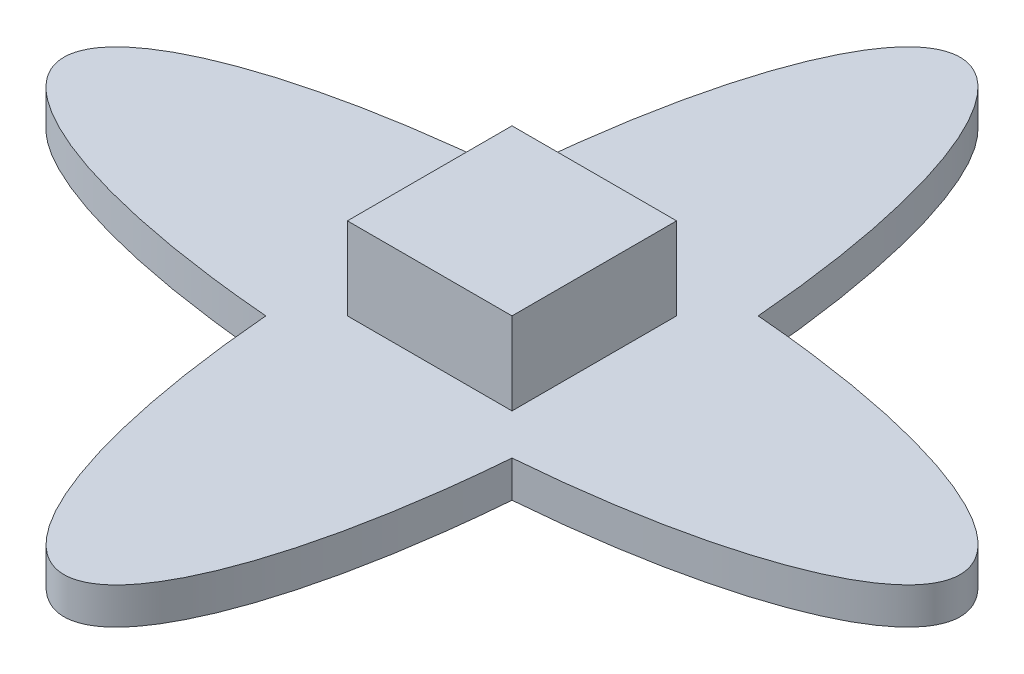
ISO-10303-21;
HEADER;
FILE_DESCRIPTION(('STEP AP214'),'2;1');
FILE_NAME('part.step','',(''),(''),'','','');
FILE_SCHEMA(('AUTOMOTIVE_DESIGN { 1 0 10303 214 1 1 1 1 }'));
ENDSEC;
DATA;
#1=APPLICATION_CONTEXT('core data for automotive mechanical design processes');
#2=APPLICATION_PROTOCOL_DEFINITION('international standard','automotive_design',2000,#1);
#3=PRODUCT_CONTEXT('',#1,'mechanical');
#4=PRODUCT('Part','Part','',(#3));
#5=PRODUCT_RELATED_PRODUCT_CATEGORY('part','',(#4));
#6=PRODUCT_DEFINITION_FORMATION('','',#4);
#7=PRODUCT_DEFINITION_CONTEXT('part definition',#1,'design');
#8=PRODUCT_DEFINITION('design','',#6,#7);
#9=PRODUCT_DEFINITION_SHAPE('','',#8);
#10=(LENGTH_UNIT() NAMED_UNIT(*) SI_UNIT(.MILLI.,.METRE.));
#11=(NAMED_UNIT(*) PLANE_ANGLE_UNIT() SI_UNIT($,.RADIAN.));
#12=(NAMED_UNIT(*) SI_UNIT($,.STERADIAN.) SOLID_ANGLE_UNIT());
#13=UNCERTAINTY_MEASURE_WITH_UNIT(LENGTH_MEASURE(1.E-05),#10,'distance_accuracy_value','');
#14=(GEOMETRIC_REPRESENTATION_CONTEXT(3) GLOBAL_UNCERTAINTY_ASSIGNED_CONTEXT((#13)) GLOBAL_UNIT_ASSIGNED_CONTEXT((#10,
#11,#12)) REPRESENTATION_CONTEXT('',''));
#15=CARTESIAN_POINT('',(0.,0.,0.));
#16=DIRECTION('',(0.,0.,1.));
#17=DIRECTION('',(1.,0.,0.));
#18=AXIS2_PLACEMENT_3D('',#15,#16,#17);
#19=CARTESIAN_POINT('',(0.,2.,0.));
#20=DIRECTION('',(0.,1.,0.));
#21=DIRECTION('',(0.,0.,1.));
#22=AXIS2_PLACEMENT_3D('',#19,#20,#21);
#23=PLANE('',#22);
#24=CARTESIAN_POINT('',(0.,2.,0.));
#25=DIRECTION('',(0.,1.,0.));
#26=DIRECTION('',(0.,0.,1.));
#27=AXIS2_PLACEMENT_3D('',#24,#25,#26);
#28=ELLIPSE('',#27,24.5,7.);
#29=CARTESIAN_POINT('',(-6.73066763348577,2.,6.73066763348574));
#30=VERTEX_POINT('',#29);
#31=CARTESIAN_POINT('',(6.73066763348576,2.,6.73066763348578));
#32=VERTEX_POINT('',#31);
#33=EDGE_CURVE('E152',#30,#32,#28,.T.);
#34=ORIENTED_EDGE('',*,*,#33,.T.);
#35=CARTESIAN_POINT('',(0.,2.,0.));
#36=DIRECTION('',(0.,1.,0.));
#37=DIRECTION('',(-1.,0.,0.));
#38=AXIS2_PLACEMENT_3D('',#35,#36,#37);
#39=ELLIPSE('',#38,24.5,7.);
#40=CARTESIAN_POINT('',(6.73066763348576,2.,-6.73066763348574));
#41=VERTEX_POINT('',#40);
#42=EDGE_CURVE('E93',#32,#41,#39,.T.);
#43=ORIENTED_EDGE('',*,*,#42,.T.);
#44=CARTESIAN_POINT('',(0.,2.,0.));
#45=DIRECTION('',(0.,1.,0.));
#46=DIRECTION('',(0.,0.,1.));
#47=AXIS2_PLACEMENT_3D('',#44,#45,#46);
#48=ELLIPSE('',#47,24.5,7.);
#49=CARTESIAN_POINT('',(-6.73066763348576,2.,-6.73066763348578));
#50=VERTEX_POINT('',#49);
#51=EDGE_CURVE('E159',#41,#50,#48,.T.);
#52=ORIENTED_EDGE('',*,*,#51,.T.);
#53=CARTESIAN_POINT('',(0.,2.,0.));
#54=DIRECTION('',(0.,1.,0.));
#55=DIRECTION('',(-1.,0.,0.));
#56=AXIS2_PLACEMENT_3D('',#53,#54,#55);
#57=ELLIPSE('',#56,24.5,7.);
#58=EDGE_CURVE('E65',#50,#30,#57,.T.);
#59=ORIENTED_EDGE('',*,*,#58,.T.);
#60=EDGE_LOOP('',(#34,#43,#52,#59));
#61=FACE_BOUND('',#60,.T.);
#62=DIRECTION('',(-1.,0.,0.));
#63=VECTOR('',#62,1.);
#64=CARTESIAN_POINT('',(-4.5,2.,-4.5));
#65=LINE('',#64,#63);
#66=CARTESIAN_POINT('',(4.5,2.,-4.5));
#67=VERTEX_POINT('',#66);
#68=CARTESIAN_POINT('',(-4.5,2.,-4.5));
#69=VERTEX_POINT('',#68);
#70=EDGE_CURVE('E203',#67,#69,#65,.T.);
#71=ORIENTED_EDGE('',*,*,#70,.F.);
#72=DIRECTION('',(0.,0.,-1.));
#73=VECTOR('',#72,1.);
#74=CARTESIAN_POINT('',(4.5,2.,4.5));
#75=LINE('',#74,#73);
#76=CARTESIAN_POINT('',(4.5,2.,4.5));
#77=VERTEX_POINT('',#76);
#78=EDGE_CURVE('E140',#77,#67,#75,.T.);
#79=ORIENTED_EDGE('',*,*,#78,.F.);
#80=DIRECTION('',(1.,0.,0.));
#81=VECTOR('',#80,1.);
#82=CARTESIAN_POINT('',(-4.5,2.,4.5));
#83=LINE('',#82,#81);
#84=CARTESIAN_POINT('',(-4.5,2.,4.5));
#85=VERTEX_POINT('',#84);
#86=EDGE_CURVE('E136',#85,#77,#83,.T.);
#87=ORIENTED_EDGE('',*,*,#86,.F.);
#88=DIRECTION('',(0.,0.,1.));
#89=VECTOR('',#88,1.);
#90=CARTESIAN_POINT('',(-4.5,2.,4.5));
#91=LINE('',#90,#89);
#92=EDGE_CURVE('E205',#69,#85,#91,.T.);
#93=ORIENTED_EDGE('',*,*,#92,.F.);
#94=EDGE_LOOP('',(#71,#79,#87,#93));
#95=FACE_BOUND('',#94,.T.);
#96=ADVANCED_FACE('F39',(#61,#95),#23,.T.);
#97=DIRECTION('',(0.,-1.,0.));
#98=VECTOR('',#97,1.);
#99=SURFACE_OF_LINEAR_EXTRUSION('',#28,#98);
#100=CARTESIAN_POINT('',(0.,0.,0.));
#101=DIRECTION('',(0.,1.,0.));
#102=DIRECTION('',(0.,0.,1.));
#103=AXIS2_PLACEMENT_3D('',#100,#101,#102);
#104=ELLIPSE('',#103,24.5,7.);
#105=CARTESIAN_POINT('',(-6.73066763348577,0.,6.73066763348574));
#106=VERTEX_POINT('',#105);
#107=CARTESIAN_POINT('',(6.73066763348576,0.,6.73066763348578));
#108=VERTEX_POINT('',#107);
#109=EDGE_CURVE('E143',#106,#108,#104,.T.);
#110=ORIENTED_EDGE('',*,*,#109,.T.);
#111=DIRECTION('',(0.,-1.,0.));
#112=VECTOR('',#111,1.);
#113=CARTESIAN_POINT('',(6.73066763348576,2.,6.73066763348578));
#114=LINE('',#113,#112);
#115=EDGE_CURVE('E11',#32,#108,#114,.T.);
#116=ORIENTED_EDGE('',*,*,#115,.F.);
#117=ORIENTED_EDGE('',*,*,#33,.F.);
#118=DIRECTION('',(0.,-1.,0.));
#119=VECTOR('',#118,1.);
#120=CARTESIAN_POINT('',(-6.73066763348577,2.,6.73066763348574));
#121=LINE('',#120,#119);
#122=EDGE_CURVE('E176',#30,#106,#121,.T.);
#123=ORIENTED_EDGE('',*,*,#122,.T.);
#124=EDGE_LOOP('',(#110,#116,#117,#123));
#125=FACE_BOUND('',#124,.T.);
#126=ADVANCED_FACE('F41',(#125),#99,.F.);
#127=DIRECTION('',(0.,-1.,0.));
#128=VECTOR('',#127,1.);
#129=SURFACE_OF_LINEAR_EXTRUSION('',#39,#128);
#130=CARTESIAN_POINT('',(0.,0.,0.));
#131=DIRECTION('',(0.,1.,0.));
#132=DIRECTION('',(-1.,0.,0.));
#133=AXIS2_PLACEMENT_3D('',#130,#131,#132);
#134=ELLIPSE('',#133,24.5,7.);
#135=CARTESIAN_POINT('',(6.73066763348576,0.,-6.73066763348574));
#136=VERTEX_POINT('',#135);
#137=EDGE_CURVE('E148',#108,#136,#134,.T.);
#138=ORIENTED_EDGE('',*,*,#137,.T.);
#139=DIRECTION('',(0.,-1.,0.));
#140=VECTOR('',#139,1.);
#141=CARTESIAN_POINT('',(6.73066763348576,2.,-6.73066763348574));
#142=LINE('',#141,#140);
#143=EDGE_CURVE('E49',#41,#136,#142,.T.);
#144=ORIENTED_EDGE('',*,*,#143,.F.);
#145=ORIENTED_EDGE('',*,*,#42,.F.);
#146=ORIENTED_EDGE('',*,*,#115,.T.);
#147=EDGE_LOOP('',(#138,#144,#145,#146));
#148=FACE_BOUND('',#147,.T.);
#149=ADVANCED_FACE('F162',(#148),#129,.F.);
#150=DIRECTION('',(0.,-1.,0.));
#151=VECTOR('',#150,1.);
#152=SURFACE_OF_LINEAR_EXTRUSION('',#48,#151);
#153=CARTESIAN_POINT('',(0.,0.,0.));
#154=DIRECTION('',(0.,1.,0.));
#155=DIRECTION('',(0.,0.,1.));
#156=AXIS2_PLACEMENT_3D('',#153,#154,#155);
#157=ELLIPSE('',#156,24.5,7.);
#158=CARTESIAN_POINT('',(-6.73066763348576,0.,-6.73066763348578));
#159=VERTEX_POINT('',#158);
#160=EDGE_CURVE('E180',#136,#159,#157,.T.);
#161=ORIENTED_EDGE('',*,*,#160,.T.);
#162=DIRECTION('',(0.,-1.,0.));
#163=VECTOR('',#162,1.);
#164=CARTESIAN_POINT('',(-6.73066763348576,2.,-6.73066763348578));
#165=LINE('',#164,#163);
#166=EDGE_CURVE('E187',#50,#159,#165,.T.);
#167=ORIENTED_EDGE('',*,*,#166,.F.);
#168=ORIENTED_EDGE('',*,*,#51,.F.);
#169=ORIENTED_EDGE('',*,*,#143,.T.);
#170=EDGE_LOOP('',(#161,#167,#168,#169));
#171=FACE_BOUND('',#170,.T.);
#172=ADVANCED_FACE('F165',(#171),#152,.F.);
#173=DIRECTION('',(0.,-1.,0.));
#174=VECTOR('',#173,1.);
#175=SURFACE_OF_LINEAR_EXTRUSION('',#57,#174);
#176=CARTESIAN_POINT('',(0.,0.,0.));
#177=DIRECTION('',(0.,1.,0.));
#178=DIRECTION('',(-1.,0.,0.));
#179=AXIS2_PLACEMENT_3D('',#176,#177,#178);
#180=ELLIPSE('',#179,24.5,7.);
#181=EDGE_CURVE('E86',#159,#106,#180,.T.);
#182=ORIENTED_EDGE('',*,*,#181,.T.);
#183=ORIENTED_EDGE('',*,*,#122,.F.);
#184=ORIENTED_EDGE('',*,*,#58,.F.);
#185=ORIENTED_EDGE('',*,*,#166,.T.);
#186=EDGE_LOOP('',(#182,#183,#184,#185));
#187=FACE_BOUND('',#186,.T.);
#188=ADVANCED_FACE('F168',(#187),#175,.F.);
#189=CARTESIAN_POINT('',(0.,0.,0.));
#190=DIRECTION('',(0.,1.,0.));
#191=DIRECTION('',(0.,0.,1.));
#192=AXIS2_PLACEMENT_3D('',#189,#190,#191);
#193=PLANE('',#192);
#194=ORIENTED_EDGE('',*,*,#109,.F.);
#195=ORIENTED_EDGE('',*,*,#181,.F.);
#196=ORIENTED_EDGE('',*,*,#160,.F.);
#197=ORIENTED_EDGE('',*,*,#137,.F.);
#198=EDGE_LOOP('',(#194,#195,#196,#197));
#199=FACE_BOUND('',#198,.T.);
#200=ADVANCED_FACE('F172',(#199),#193,.F.);
#201=CARTESIAN_POINT('',(4.5,6.5,4.5));
#202=DIRECTION('',(-1.,0.,0.));
#203=DIRECTION('',(0.,0.,1.));
#204=AXIS2_PLACEMENT_3D('',#201,#202,#203);
#205=PLANE('',#204);
#206=ORIENTED_EDGE('',*,*,#78,.T.);
#207=DIRECTION('',(0.,-1.,0.));
#208=VECTOR('',#207,1.);
#209=CARTESIAN_POINT('',(4.5,6.5,-4.5));
#210=LINE('',#209,#208);
#211=CARTESIAN_POINT('',(4.5,6.5,-4.5));
#212=VERTEX_POINT('',#211);
#213=EDGE_CURVE('E119',#212,#67,#210,.T.);
#214=ORIENTED_EDGE('',*,*,#213,.F.);
#215=DIRECTION('',(0.,0.,-1.));
#216=VECTOR('',#215,1.);
#217=CARTESIAN_POINT('',(4.5,6.5,4.5));
#218=LINE('',#217,#216);
#219=CARTESIAN_POINT('',(4.5,6.5,4.5));
#220=VERTEX_POINT('',#219);
#221=EDGE_CURVE('E127',#220,#212,#218,.T.);
#222=ORIENTED_EDGE('',*,*,#221,.F.);
#223=DIRECTION('',(0.,-1.,0.));
#224=VECTOR('',#223,1.);
#225=CARTESIAN_POINT('',(4.5,6.5,4.5));
#226=LINE('',#225,#224);
#227=EDGE_CURVE('E216',#220,#77,#226,.T.);
#228=ORIENTED_EDGE('',*,*,#227,.T.);
#229=EDGE_LOOP('',(#206,#214,#222,#228));
#230=FACE_BOUND('',#229,.T.);
#231=ADVANCED_FACE('F138',(#230),#205,.F.);
#232=CARTESIAN_POINT('',(-4.5,6.5,-4.5));
#233=DIRECTION('',(0.,0.,1.));
#234=DIRECTION('',(1.,0.,0.));
#235=AXIS2_PLACEMENT_3D('',#232,#233,#234);
#236=PLANE('',#235);
#237=ORIENTED_EDGE('',*,*,#70,.T.);
#238=DIRECTION('',(0.,-1.,0.));
#239=VECTOR('',#238,1.);
#240=CARTESIAN_POINT('',(-4.5,6.5,-4.5));
#241=LINE('',#240,#239);
#242=CARTESIAN_POINT('',(-4.5,6.5,-4.5));
#243=VERTEX_POINT('',#242);
#244=EDGE_CURVE('E122',#243,#69,#241,.T.);
#245=ORIENTED_EDGE('',*,*,#244,.F.);
#246=DIRECTION('',(-1.,0.,0.));
#247=VECTOR('',#246,1.);
#248=CARTESIAN_POINT('',(-4.5,6.5,-4.5));
#249=LINE('',#248,#247);
#250=EDGE_CURVE('E115',#212,#243,#249,.T.);
#251=ORIENTED_EDGE('',*,*,#250,.F.);
#252=ORIENTED_EDGE('',*,*,#213,.T.);
#253=EDGE_LOOP('',(#237,#245,#251,#252));
#254=FACE_BOUND('',#253,.T.);
#255=ADVANCED_FACE('F117',(#254),#236,.F.);
#256=CARTESIAN_POINT('',(-4.5,6.5,4.5));
#257=DIRECTION('',(1.,0.,0.));
#258=DIRECTION('',(0.,0.,-1.));
#259=AXIS2_PLACEMENT_3D('',#256,#257,#258);
#260=PLANE('',#259);
#261=ORIENTED_EDGE('',*,*,#92,.T.);
#262=DIRECTION('',(0.,-1.,0.));
#263=VECTOR('',#262,1.);
#264=CARTESIAN_POINT('',(-4.5,6.5,4.5));
#265=LINE('',#264,#263);
#266=CARTESIAN_POINT('',(-4.5,6.5,4.5));
#267=VERTEX_POINT('',#266);
#268=EDGE_CURVE('E56',#267,#85,#265,.T.);
#269=ORIENTED_EDGE('',*,*,#268,.F.);
#270=DIRECTION('',(0.,0.,1.));
#271=VECTOR('',#270,1.);
#272=CARTESIAN_POINT('',(-4.5,6.5,4.5));
#273=LINE('',#272,#271);
#274=EDGE_CURVE('E126',#243,#267,#273,.T.);
#275=ORIENTED_EDGE('',*,*,#274,.F.);
#276=ORIENTED_EDGE('',*,*,#244,.T.);
#277=EDGE_LOOP('',(#261,#269,#275,#276));
#278=FACE_BOUND('',#277,.T.);
#279=ADVANCED_FACE('F223',(#278),#260,.F.);
#280=CARTESIAN_POINT('',(-4.5,6.5,4.5));
#281=DIRECTION('',(0.,0.,-1.));
#282=DIRECTION('',(-1.,0.,0.));
#283=AXIS2_PLACEMENT_3D('',#280,#281,#282);
#284=PLANE('',#283);
#285=ORIENTED_EDGE('',*,*,#86,.T.);
#286=ORIENTED_EDGE('',*,*,#227,.F.);
#287=DIRECTION('',(1.,0.,0.));
#288=VECTOR('',#287,1.);
#289=CARTESIAN_POINT('',(-4.5,6.5,4.5));
#290=LINE('',#289,#288);
#291=EDGE_CURVE('E131',#267,#220,#290,.T.);
#292=ORIENTED_EDGE('',*,*,#291,.F.);
#293=ORIENTED_EDGE('',*,*,#268,.T.);
#294=EDGE_LOOP('',(#285,#286,#292,#293));
#295=FACE_BOUND('',#294,.T.);
#296=ADVANCED_FACE('F224',(#295),#284,.F.);
#297=CARTESIAN_POINT('',(0.,6.5,0.));
#298=DIRECTION('',(0.,-1.,0.));
#299=DIRECTION('',(0.,0.,-1.));
#300=AXIS2_PLACEMENT_3D('',#297,#298,#299);
#301=PLANE('',#300);
#302=ORIENTED_EDGE('',*,*,#221,.T.);
#303=ORIENTED_EDGE('',*,*,#250,.T.);
#304=ORIENTED_EDGE('',*,*,#274,.T.);
#305=ORIENTED_EDGE('',*,*,#291,.T.);
#306=EDGE_LOOP('',(#302,#303,#304,#305));
#307=FACE_BOUND('',#306,.T.);
#308=ADVANCED_FACE('F130',(#307),#301,.F.);
#309=CLOSED_SHELL('',(#96,#126,#149,#172,#188,#200,#231,#255,#279,#296,#308));
#310=MANIFOLD_SOLID_BREP('B2',#309);
#311=ADVANCED_BREP_SHAPE_REPRESENTATION('',(#18,#310),#14);
#312=SHAPE_DEFINITION_REPRESENTATION(#9,#311);
ENDSEC;
END-ISO-10303-21;
